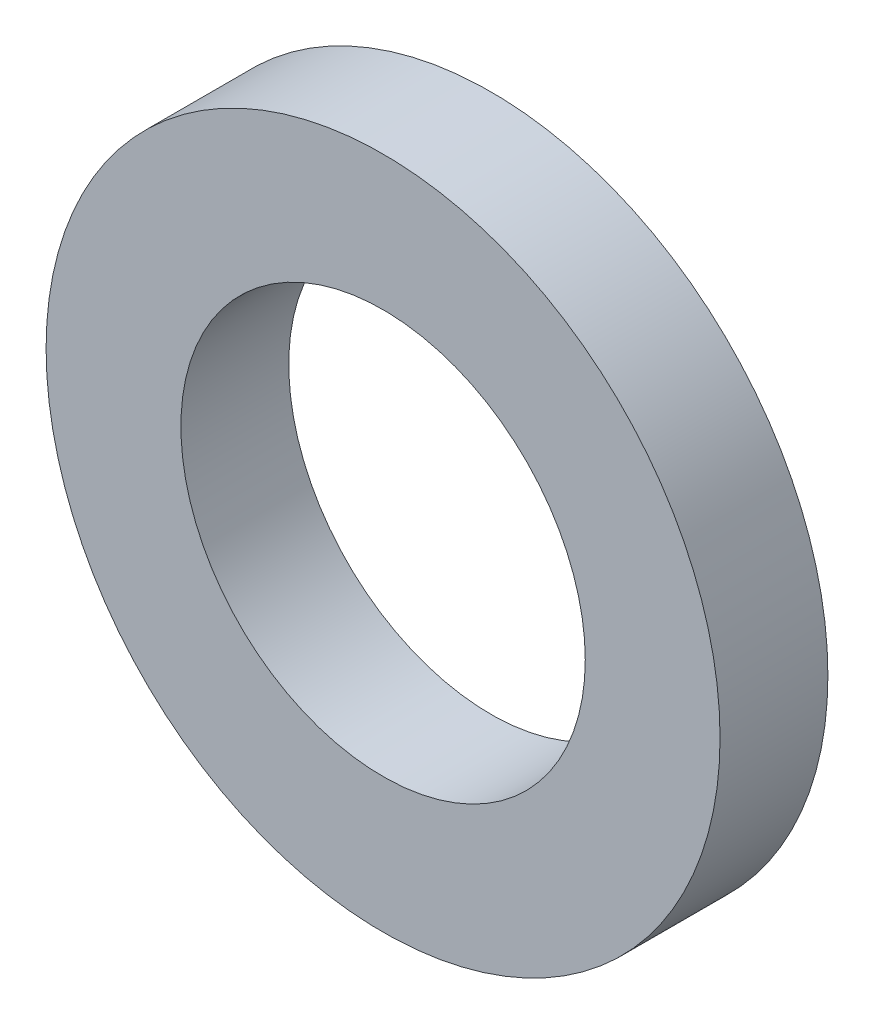
ISO-10303-21;
HEADER;
FILE_DESCRIPTION(('STEP AP214'),'2;1');
FILE_NAME('part.step','',(''),(''),'','','');
FILE_SCHEMA(('AUTOMOTIVE_DESIGN { 1 0 10303 214 1 1 1 1 }'));
ENDSEC;
DATA;
#1=APPLICATION_CONTEXT('core data for automotive mechanical design processes');
#2=APPLICATION_PROTOCOL_DEFINITION('international standard','automotive_design',2000,#1);
#3=PRODUCT_CONTEXT('',#1,'mechanical');
#4=PRODUCT('Part','Part','',(#3));
#5=PRODUCT_RELATED_PRODUCT_CATEGORY('part','',(#4));
#6=PRODUCT_DEFINITION_FORMATION('','',#4);
#7=PRODUCT_DEFINITION_CONTEXT('part definition',#1,'design');
#8=PRODUCT_DEFINITION('design','',#6,#7);
#9=PRODUCT_DEFINITION_SHAPE('','',#8);
#10=(LENGTH_UNIT() NAMED_UNIT(*) SI_UNIT(.MILLI.,.METRE.));
#11=(NAMED_UNIT(*) PLANE_ANGLE_UNIT() SI_UNIT($,.RADIAN.));
#12=(NAMED_UNIT(*) SI_UNIT($,.STERADIAN.) SOLID_ANGLE_UNIT());
#13=UNCERTAINTY_MEASURE_WITH_UNIT(LENGTH_MEASURE(1.E-05),#10,'distance_accuracy_value','');
#14=(GEOMETRIC_REPRESENTATION_CONTEXT(3) GLOBAL_UNCERTAINTY_ASSIGNED_CONTEXT((#13)) GLOBAL_UNIT_ASSIGNED_CONTEXT((#10,
#11,#12)) REPRESENTATION_CONTEXT('',''));
#15=CARTESIAN_POINT('',(0.,0.,0.));
#16=DIRECTION('',(0.,0.,1.));
#17=DIRECTION('',(1.,0.,0.));
#18=AXIS2_PLACEMENT_3D('',#15,#16,#17);
#19=CARTESIAN_POINT('',(0.,0.,1.2));
#20=DIRECTION('',(0.,0.,1.));
#21=DIRECTION('',(1.,0.,0.));
#22=AXIS2_PLACEMENT_3D('',#19,#20,#21);
#23=PLANE('',#22);
#24=CARTESIAN_POINT('',(0.,0.,1.2));
#25=DIRECTION('',(0.,0.,1.));
#26=DIRECTION('',(1.,0.,0.));
#27=AXIS2_PLACEMENT_3D('',#24,#25,#26);
#28=CIRCLE('',#27,3.75);
#29=CARTESIAN_POINT('',(3.75,0.,1.2));
#30=VERTEX_POINT('',#29);
#31=EDGE_CURVE('E10',#30,#30,#28,.T.);
#32=ORIENTED_EDGE('',*,*,#31,.T.);
#33=EDGE_LOOP('',(#32));
#34=FACE_BOUND('',#33,.T.);
#35=CARTESIAN_POINT('',(0.,0.,1.2));
#36=DIRECTION('',(0.,0.,1.));
#37=DIRECTION('',(1.,0.,0.));
#38=AXIS2_PLACEMENT_3D('',#35,#36,#37);
#39=CIRCLE('',#38,2.25);
#40=CARTESIAN_POINT('',(2.25,0.,1.2));
#41=VERTEX_POINT('',#40);
#42=EDGE_CURVE('E42',#41,#41,#39,.T.);
#43=ORIENTED_EDGE('',*,*,#42,.F.);
#44=EDGE_LOOP('',(#43));
#45=FACE_BOUND('',#44,.T.);
#46=ADVANCED_FACE('F31',(#34,#45),#23,.T.);
#47=CARTESIAN_POINT('',(0.,0.,0.));
#48=DIRECTION('',(0.,0.,1.));
#49=DIRECTION('',(1.,0.,0.));
#50=AXIS2_PLACEMENT_3D('',#47,#48,#49);
#51=PLANE('',#50);
#52=CARTESIAN_POINT('',(0.,0.,0.));
#53=DIRECTION('',(0.,0.,1.));
#54=DIRECTION('',(1.,0.,0.));
#55=AXIS2_PLACEMENT_3D('',#52,#53,#54);
#56=CIRCLE('',#55,3.75);
#57=CARTESIAN_POINT('',(3.75,0.,0.));
#58=VERTEX_POINT('',#57);
#59=EDGE_CURVE('E35',#58,#58,#56,.T.);
#60=ORIENTED_EDGE('',*,*,#59,.F.);
#61=EDGE_LOOP('',(#60));
#62=FACE_BOUND('',#61,.T.);
#63=CARTESIAN_POINT('',(0.,0.,0.));
#64=DIRECTION('',(0.,0.,1.));
#65=DIRECTION('',(1.,0.,0.));
#66=AXIS2_PLACEMENT_3D('',#63,#64,#65);
#67=CIRCLE('',#66,2.25);
#68=CARTESIAN_POINT('',(2.25,0.,0.));
#69=VERTEX_POINT('',#68);
#70=EDGE_CURVE('E44',#69,#69,#67,.T.);
#71=ORIENTED_EDGE('',*,*,#70,.T.);
#72=EDGE_LOOP('',(#71));
#73=FACE_BOUND('',#72,.T.);
#74=ADVANCED_FACE('F54',(#62,#73),#51,.F.);
#75=CARTESIAN_POINT('',(0.,0.,1.2));
#76=DIRECTION('',(0.,0.,-1.));
#77=DIRECTION('',(-1.,0.,0.));
#78=AXIS2_PLACEMENT_3D('',#75,#76,#77);
#79=CYLINDRICAL_SURFACE('',#78,3.75);
#80=ORIENTED_EDGE('',*,*,#31,.F.);
#81=EDGE_LOOP('',(#80));
#82=FACE_BOUND('',#81,.T.);
#83=ORIENTED_EDGE('',*,*,#59,.T.);
#84=EDGE_LOOP('',(#83));
#85=FACE_BOUND('',#84,.T.);
#86=ADVANCED_FACE('F33',(#82,#85),#79,.T.);
#87=CARTESIAN_POINT('',(0.,0.,1.2));
#88=DIRECTION('',(0.,0.,-1.));
#89=DIRECTION('',(-1.,0.,0.));
#90=AXIS2_PLACEMENT_3D('',#87,#88,#89);
#91=CYLINDRICAL_SURFACE('',#90,2.25);
#92=ORIENTED_EDGE('',*,*,#42,.T.);
#93=EDGE_LOOP('',(#92));
#94=FACE_BOUND('',#93,.T.);
#95=ORIENTED_EDGE('',*,*,#70,.F.);
#96=EDGE_LOOP('',(#95));
#97=FACE_BOUND('',#96,.T.);
#98=ADVANCED_FACE('F50',(#94,#97),#91,.F.);
#99=CLOSED_SHELL('',(#46,#74,#86,#98));
#100=MANIFOLD_SOLID_BREP('B2',#99);
#101=ADVANCED_BREP_SHAPE_REPRESENTATION('',(#18,#100),#14);
#102=SHAPE_DEFINITION_REPRESENTATION(#9,#101);
ENDSEC;
END-ISO-10303-21;
